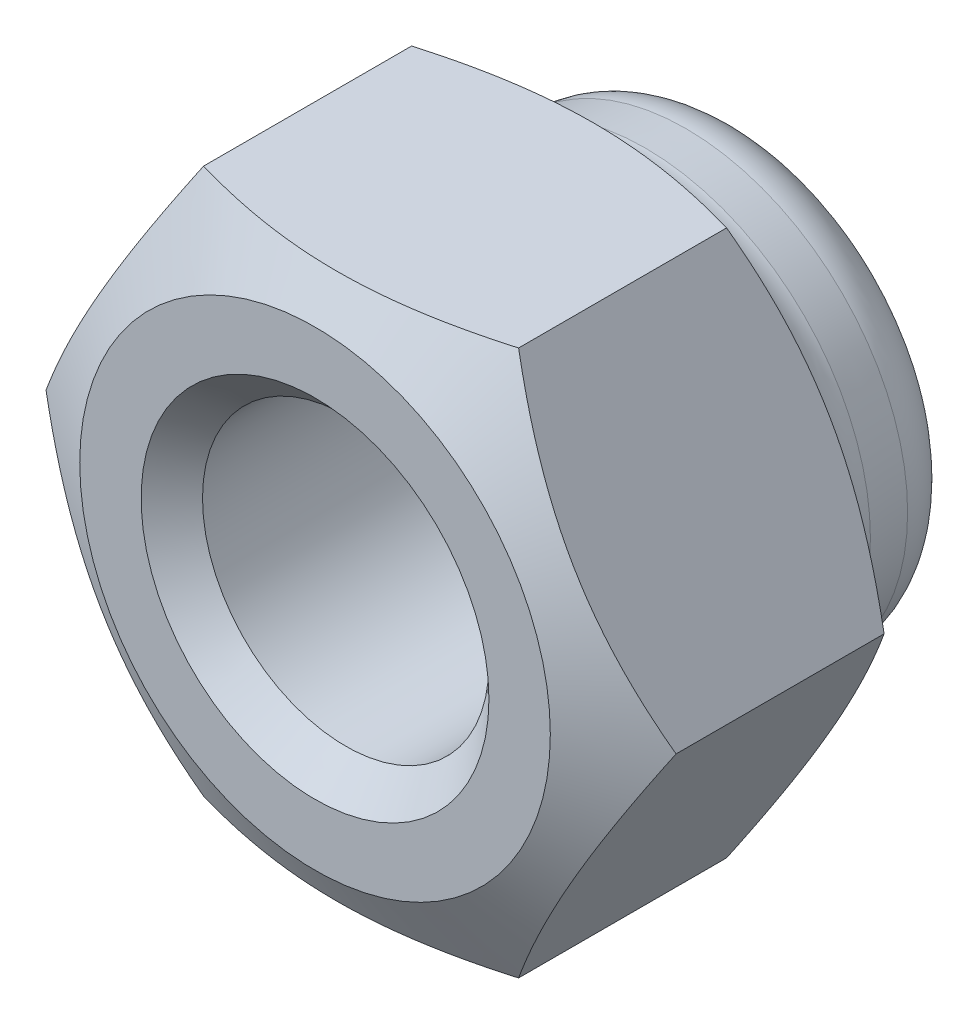
ISO-10303-21;
HEADER;
FILE_DESCRIPTION(('STEP AP214'),'2;1');
FILE_NAME('part.step','',(''),(''),'','','');
FILE_SCHEMA(('AUTOMOTIVE_DESIGN { 1 0 10303 214 1 1 1 1 }'));
ENDSEC;
DATA;
#1=APPLICATION_CONTEXT('core data for automotive mechanical design processes');
#2=APPLICATION_PROTOCOL_DEFINITION('international standard','automotive_design',2000,#1);
#3=PRODUCT_CONTEXT('',#1,'mechanical');
#4=PRODUCT('Part','Part','',(#3));
#5=PRODUCT_RELATED_PRODUCT_CATEGORY('part','',(#4));
#6=PRODUCT_DEFINITION_FORMATION('','',#4);
#7=PRODUCT_DEFINITION_CONTEXT('part definition',#1,'design');
#8=PRODUCT_DEFINITION('design','',#6,#7);
#9=PRODUCT_DEFINITION_SHAPE('','',#8);
#10=(LENGTH_UNIT() NAMED_UNIT(*) SI_UNIT(.MILLI.,.METRE.));
#11=(NAMED_UNIT(*) PLANE_ANGLE_UNIT() SI_UNIT($,.RADIAN.));
#12=(NAMED_UNIT(*) SI_UNIT($,.STERADIAN.) SOLID_ANGLE_UNIT());
#13=UNCERTAINTY_MEASURE_WITH_UNIT(LENGTH_MEASURE(1.E-05),#10,'distance_accuracy_value','');
#14=(GEOMETRIC_REPRESENTATION_CONTEXT(3) GLOBAL_UNCERTAINTY_ASSIGNED_CONTEXT((#13)) GLOBAL_UNIT_ASSIGNED_CONTEXT((#10,
#11,#12)) REPRESENTATION_CONTEXT('',''));
#15=CARTESIAN_POINT('',(0.,0.,0.));
#16=DIRECTION('',(0.,0.,1.));
#17=DIRECTION('',(1.,0.,0.));
#18=AXIS2_PLACEMENT_3D('',#15,#16,#17);
#19=CARTESIAN_POINT('',(0.,0.,-6.16127494350649));
#20=DIRECTION('',(0.,0.,1.));
#21=DIRECTION('',(1.,0.,0.));
#22=AXIS2_PLACEMENT_3D('',#19,#20,#21);
#23=TOROIDAL_SURFACE('',#22,2.38872505649352,0.138725056493513);
#24=CARTESIAN_POINT('',(0.,0.,-6.3));
#25=DIRECTION('',(0.,0.,1.));
#26=DIRECTION('',(1.,0.,0.));
#27=AXIS2_PLACEMENT_3D('',#24,#25,#26);
#28=CIRCLE('',#27,2.38872505649352);
#29=CARTESIAN_POINT('',(2.38872505649352,0.,-6.3));
#30=VERTEX_POINT('',#29);
#31=EDGE_CURVE('E111',#30,#30,#28,.T.);
#32=ORIENTED_EDGE('',*,*,#31,.F.);
#33=EDGE_LOOP('',(#32));
#34=FACE_BOUND('',#33,.T.);
#35=CARTESIAN_POINT('',(0.,0.,-6.16127494350648));
#36=DIRECTION('',(0.,0.,1.));
#37=DIRECTION('',(1.,0.,0.));
#38=AXIS2_PLACEMENT_3D('',#35,#36,#37);
#39=CIRCLE('',#38,2.25000000000001);
#40=CARTESIAN_POINT('',(2.25000000000001,0.,-6.16127494350648));
#41=VERTEX_POINT('',#40);
#42=EDGE_CURVE('E136',#41,#41,#39,.T.);
#43=ORIENTED_EDGE('',*,*,#42,.T.);
#44=EDGE_LOOP('',(#43));
#45=FACE_BOUND('',#44,.T.);
#46=ADVANCED_FACE('F38',(#34,#45),#23,.T.);
#47=CARTESIAN_POINT('',(0.,0.,-5.43872505649352));
#48=DIRECTION('',(0.,0.,1.));
#49=DIRECTION('',(1.,0.,0.));
#50=AXIS2_PLACEMENT_3D('',#47,#48,#49);
#51=TOROIDAL_SURFACE('',#50,2.38872505649352,0.86127494350648);
#52=CARTESIAN_POINT('',(0.,0.,-5.43872505649352));
#53=DIRECTION('',(0.,0.,1.));
#54=DIRECTION('',(1.,0.,0.));
#55=AXIS2_PLACEMENT_3D('',#52,#53,#54);
#56=CIRCLE('',#55,3.25);
#57=CARTESIAN_POINT('',(3.25,0.,-5.43872505649352));
#58=VERTEX_POINT('',#57);
#59=EDGE_CURVE('E115',#58,#58,#56,.T.);
#60=ORIENTED_EDGE('',*,*,#59,.F.);
#61=EDGE_LOOP('',(#60));
#62=FACE_BOUND('',#61,.T.);
#63=ORIENTED_EDGE('',*,*,#31,.T.);
#64=EDGE_LOOP('',(#63));
#65=FACE_BOUND('',#64,.T.);
#66=ADVANCED_FACE('F257',(#62,#65),#51,.T.);
#67=CARTESIAN_POINT('',(0.,0.,-5.43872505649352));
#68=DIRECTION('',(0.,0.,1.));
#69=DIRECTION('',(1.,0.,0.));
#70=AXIS2_PLACEMENT_3D('',#67,#68,#69);
#71=CONICAL_SURFACE('',#70,3.25,0.0872664625997129);
#72=CARTESIAN_POINT('',(0.,0.,-4.84100823763847));
#73=DIRECTION('',(0.,0.,1.));
#74=DIRECTION('',(1.,0.,0.));
#75=AXIS2_PLACEMENT_3D('',#72,#73,#74);
#76=CIRCLE('',#75,3.30229344564859);
#77=CARTESIAN_POINT('',(3.30229344564859,0.,-4.84100823763847));
#78=VERTEX_POINT('',#77);
#79=EDGE_CURVE('E127',#78,#78,#76,.T.);
#80=ORIENTED_EDGE('',*,*,#79,.F.);
#81=EDGE_LOOP('',(#80));
#82=FACE_BOUND('',#81,.T.);
#83=ORIENTED_EDGE('',*,*,#59,.T.);
#84=EDGE_LOOP('',(#83));
#85=FACE_BOUND('',#84,.T.);
#86=ADVANCED_FACE('F263',(#82,#85),#71,.T.);
#87=CARTESIAN_POINT('',(0.,0.,-4.84100823763847));
#88=DIRECTION('',(0.,0.,1.));
#89=DIRECTION('',(1.,0.,0.));
#90=AXIS2_PLACEMENT_3D('',#87,#88,#89);
#91=TOROIDAL_SURFACE('',#90,4.03450703228722,0.732213586638629);
#92=CARTESIAN_POINT('',(0.,0.,-4.4));
#93=DIRECTION('',(0.,0.,1.));
#94=DIRECTION('',(1.,0.,0.));
#95=AXIS2_PLACEMENT_3D('',#92,#93,#94);
#96=CIRCLE('',#95,3.45);
#97=CARTESIAN_POINT('',(3.45,0.,-4.4));
#98=VERTEX_POINT('',#97);
#99=EDGE_CURVE('E283',#98,#98,#96,.T.);
#100=ORIENTED_EDGE('',*,*,#99,.F.);
#101=EDGE_LOOP('',(#100));
#102=FACE_BOUND('',#101,.T.);
#103=ORIENTED_EDGE('',*,*,#79,.T.);
#104=EDGE_LOOP('',(#103));
#105=FACE_BOUND('',#104,.T.);
#106=ADVANCED_FACE('F314',(#102,#105),#91,.F.);
#107=CARTESIAN_POINT('',(0.,0.,11.954173971306));
#108=DIRECTION('',(0.,0.,1.));
#109=DIRECTION('',(1.,0.,0.));
#110=AXIS2_PLACEMENT_3D('',#107,#108,#109);
#111=CYLINDRICAL_SURFACE('',#110,2.);
#112=CARTESIAN_POINT('',(0.,0.,-6.01127494350648));
#113=DIRECTION('',(0.,0.,1.));
#114=DIRECTION('',(1.,0.,0.));
#115=AXIS2_PLACEMENT_3D('',#112,#113,#114);
#116=CIRCLE('',#115,2.);
#117=CARTESIAN_POINT('',(2.,0.,-6.01127494350648));
#118=VERTEX_POINT('',#117);
#119=EDGE_CURVE('E130',#118,#118,#116,.T.);
#120=ORIENTED_EDGE('',*,*,#119,.F.);
#121=EDGE_LOOP('',(#120));
#122=FACE_BOUND('',#121,.T.);
#123=CARTESIAN_POINT('',(0.,0.,-4.4));
#124=DIRECTION('',(0.,0.,1.));
#125=DIRECTION('',(1.,0.,0.));
#126=AXIS2_PLACEMENT_3D('',#123,#124,#125);
#127=CIRCLE('',#126,2.);
#128=CARTESIAN_POINT('',(2.,0.,-4.4));
#129=VERTEX_POINT('',#128);
#130=EDGE_CURVE('E43',#129,#129,#127,.T.);
#131=ORIENTED_EDGE('',*,*,#130,.T.);
#132=EDGE_LOOP('',(#131));
#133=FACE_BOUND('',#132,.T.);
#134=ADVANCED_FACE('F311',(#122,#133),#111,.F.);
#135=CARTESIAN_POINT('',(0.,2.,-6.01127494350648));
#136=DIRECTION('',(0.,0.,1.));
#137=DIRECTION('',(1.,0.,0.));
#138=AXIS2_PLACEMENT_3D('',#135,#136,#137);
#139=PLANE('',#138);
#140=CARTESIAN_POINT('',(0.,0.,-6.01127494350648));
#141=DIRECTION('',(0.,0.,1.));
#142=DIRECTION('',(1.,0.,0.));
#143=AXIS2_PLACEMENT_3D('',#140,#141,#142);
#144=CIRCLE('',#143,2.25000000000001);
#145=CARTESIAN_POINT('',(2.25000000000001,0.,-6.01127494350648));
#146=VERTEX_POINT('',#145);
#147=EDGE_CURVE('E133',#146,#146,#144,.T.);
#148=ORIENTED_EDGE('',*,*,#147,.F.);
#149=EDGE_LOOP('',(#148));
#150=FACE_BOUND('',#149,.T.);
#151=ORIENTED_EDGE('',*,*,#119,.T.);
#152=EDGE_LOOP('',(#151));
#153=FACE_BOUND('',#152,.T.);
#154=ADVANCED_FACE('F313',(#150,#153),#139,.F.);
#155=CARTESIAN_POINT('',(0.,0.,11.954173971306));
#156=DIRECTION('',(0.,0.,1.));
#157=DIRECTION('',(1.,0.,0.));
#158=AXIS2_PLACEMENT_3D('',#155,#156,#157);
#159=CYLINDRICAL_SURFACE('',#158,2.25000000000001);
#160=ORIENTED_EDGE('',*,*,#42,.F.);
#161=EDGE_LOOP('',(#160));
#162=FACE_BOUND('',#161,.T.);
#163=ORIENTED_EDGE('',*,*,#147,.T.);
#164=EDGE_LOOP('',(#163));
#165=FACE_BOUND('',#164,.T.);
#166=ADVANCED_FACE('F254',(#162,#165),#159,.F.);
#167=CARTESIAN_POINT('',(0.,0.,-3.72519176203755));
#168=DIRECTION('',(0.,0.,1.));
#169=DIRECTION('',(1.,0.,0.));
#170=AXIS2_PLACEMENT_3D('',#167,#168,#169);
#171=CONICAL_SURFACE('',#170,4.61880215351701,1.0471975511966);
#172=ORIENTED_EDGE('',*,*,#99,.T.);
#173=EDGE_LOOP('',(#172));
#174=FACE_BOUND('',#173,.T.);
#175=CARTESIAN_POINT('',(-6.08093823513525,-4.,-2.18956501440732));
#176=CARTESIAN_POINT('',(-5.9072077199973,-4.,-2.2733400712056));
#177=CARTESIAN_POINT('',(-5.7330649430113,-4.,-2.3562755470918));
#178=CARTESIAN_POINT('',(-5.38373509946638,-4.,-2.51999243555252));
#179=CARTESIAN_POINT('',(-5.20854786157008,-4.,-2.60077348210659));
#180=CARTESIAN_POINT('',(-4.8559465437711,-4.,-2.76013960141361));
#181=CARTESIAN_POINT('',(-4.67852543957851,-4.,-2.8387091891028));
#182=CARTESIAN_POINT('',(-4.3222283220917,-4.,-2.99246452980912));
#183=CARTESIAN_POINT('',(-4.14335238194136,-4.,-3.06765045171811));
#184=CARTESIAN_POINT('',(-3.7786067031648,-4.,-3.21587611861329));
#185=CARTESIAN_POINT('',(-3.59268519924523,-4.,-3.28878920838275));
#186=CARTESIAN_POINT('',(-3.21862234186601,-4.,-3.42879460242122));
#187=CARTESIAN_POINT('',(-3.03048073580445,-4.,-3.49588623693079));
#188=CARTESIAN_POINT('',(-2.65207198748475,-4.,-3.62239726459421));
#189=CARTESIAN_POINT('',(-2.46181047171922,-4.,-3.68183331104212));
#190=CARTESIAN_POINT('',(-2.07856248643454,-4.,-3.79104599210788));
#191=CARTESIAN_POINT('',(-1.88557693507218,-4.,-3.84082580179269));
#192=CARTESIAN_POINT('',(-1.49780451421222,-4.,-3.92800425853516));
#193=CARTESIAN_POINT('',(-1.30303173302433,-4.,-3.9654643825502));
#194=CARTESIAN_POINT('',(-0.911198366726411,-4.,-4.02579955703458));
#195=CARTESIAN_POINT('',(-0.714137961224425,-4.,-4.04867574475032));
#196=CARTESIAN_POINT('',(-0.321233336097853,-4.,-4.07771760472641));
#197=CARTESIAN_POINT('',(-0.125404655145363,-4.,-4.08408836772128));
#198=CARTESIAN_POINT('',(0.266095201698455,-4.,-4.08011214303908));
#199=CARTESIAN_POINT('',(0.461766371360695,-4.,-4.0697645238499));
#200=CARTESIAN_POINT('',(0.797699892769408,-4.,-4.03835977606374));
#201=CARTESIAN_POINT('',(0.938331372413441,-4.,-4.02105240631739));
#202=CARTESIAN_POINT('',(1.2184766824058,-4.,-3.97894828793129));
#203=CARTESIAN_POINT('',(1.35799034157019,-4.,-3.95415041387157));
#204=CARTESIAN_POINT('',(1.77471774717106,-4.,-3.86983408504439));
#205=CARTESIAN_POINT('',(2.04994511910427,-4.,-3.80041112676984));
#206=CARTESIAN_POINT('',(2.46136777731043,-4.,-3.68114714312966));
#207=CARTESIAN_POINT('',(2.59972134145531,-4.,-3.63833689291828));
#208=CARTESIAN_POINT('',(2.87508320800016,-4.,-3.54855095588989));
#209=CARTESIAN_POINT('',(3.01209150172308,-4.,-3.50157524222502));
#210=CARTESIAN_POINT('',(3.28481206760682,-4.,-3.4041886111652));
#211=CARTESIAN_POINT('',(3.4205248105739,-4.,-3.35377900040508));
#212=CARTESIAN_POINT('',(3.69084487886413,-4.,-3.25008945380774));
#213=CARTESIAN_POINT('',(3.82545221461264,-4.,-3.19680954507686));
#214=CARTESIAN_POINT('',(4.13200825403916,-4.,-3.07229737070055));
#215=CARTESIAN_POINT('',(4.30363931346054,-4.,-3.00028468894108));
#216=CARTESIAN_POINT('',(4.64555033606362,-4.,-2.85311242153985));
#217=CARTESIAN_POINT('',(4.81583023495983,-4.,-2.77795268722296));
#218=CARTESIAN_POINT('',(5.15527612835315,-4.,-2.62509206785114));
#219=CARTESIAN_POINT('',(5.32444193760053,-4.,-2.54739077239538));
#220=CARTESIAN_POINT('',(5.6618140185516,-4.,-2.38992946119094));
#221=CARTESIAN_POINT('',(5.83002027291513,-4.,-2.31016940838137));
#222=CARTESIAN_POINT('',(6.33371414711814,-4.,-2.06824046720063));
#223=CARTESIAN_POINT('',(6.66799150373664,-4.,-1.90355291434177));
#224=CARTESIAN_POINT('',(7.33422902998934,-4.,-1.5695574486934));
#225=CARTESIAN_POINT('',(7.66618912522945,-4.,-1.40024938841454));
#226=CARTESIAN_POINT('',(8.30256102252532,-4.,-1.07164832785719));
#227=CARTESIAN_POINT('',(8.60710167211459,-4.,-0.912604408573283));
#228=CARTESIAN_POINT('',(9.21506522849463,-4.,-0.59237680702228));
#229=CARTESIAN_POINT('',(9.51848810310192,-4.,-0.431193063750126));
#230=CARTESIAN_POINT('',(10.1238060042472,-4.,-0.107528653975275));
#231=CARTESIAN_POINT('',(10.4257029105381,-4.,0.0549485014334457));
#232=CARTESIAN_POINT('',(11.0287758434504,-4.,0.381201743100219));
#233=CARTESIAN_POINT('',(11.3299519035736,-4.,0.544977767403946));
#234=CARTESIAN_POINT('',(11.6308594447685,-4.,0.709242223634977));
#235=B_SPLINE_CURVE_WITH_KNOTS('',3,(#175,#176,#177,#178,#179,#180,#181,#182,#183,#184,#185,
#186,#187,#188,#189,#190,#191,#192,#193,#194,#195,#196,#197,#198,#199,#200,#201,#202,#203,#204,
#205,#206,#207,#208,#209,#210,#211,#212,#213,#214,#215,#216,#217,#218,#219,#220,#221,#222,#223,
#224,#225,#226,#227,#228,#229,#230,#231,#232,#233,#234),.UNSPECIFIED.,.F.,.F.,(4,2,2,2,2,2,2,2,
2,2,2,2,2,2,2,2,2,2,2,2,2,2,2,2,2,2,2,2,2,4),(0.,0.578631039276284,1.15735976511556,
1.73945083153598,2.32151281123982,2.9205603426648,3.51967670347957,4.11746696013193,
4.71506032295779,5.30962469010468,5.90414268781474,6.49123717867284,7.07835384667434,
7.50322277978485,7.92815557962507,8.77854012444459,9.21298362185075,9.64742991960063,
10.0817118194367,10.5159896187462,11.0743276120865,11.6326920126257,12.1911470250296,
12.7496120975246,13.8674829625497,14.9853895525102,16.0160867873718,17.0468134701496,
18.0753356839375,19.1038091301562),.UNSPECIFIED.);
#236=CARTESIAN_POINT('',(-2.3094010767585,-4.,-3.72519176203755));
#237=VERTEX_POINT('',#236);
#238=CARTESIAN_POINT('',(2.30940107675851,-4.,-3.72519176203755));
#239=VERTEX_POINT('',#238);
#240=EDGE_CURVE('E107',#237,#239,#235,.T.);
#241=ORIENTED_EDGE('',*,*,#240,.F.);
#242=CARTESIAN_POINT('',(-4.61891762357084,0.000200000000005311,-3.72512509287095));
#243=CARTESIAN_POINT('',(-4.51743148381381,-0.175579150323223,-3.78373947829743));
#244=CARTESIAN_POINT('',(-4.41506932144052,-0.352875616326375,-3.83704703048345));
#245=CARTESIAN_POINT('',(-4.20857250547739,-0.7105385931757,-3.93009568119931));
#246=CARTESIAN_POINT('',(-4.10443418285647,-0.890911458970145,-3.96980386291601));
#247=CARTESIAN_POINT('',(-3.89744813015756,-1.24942181870278,-4.03161513666543));
#248=CARTESIAN_POINT('',(-3.79463224655059,-1.42750415293514,-4.05412962042282));
#249=CARTESIAN_POINT('',(-3.58851671999023,-1.7845067171665,-4.08100672879913));
#250=CARTESIAN_POINT('',(-3.48521782616117,-1.96342564964409,-4.08539161051877));
#251=CARTESIAN_POINT('',(-3.29219970504619,-2.29774284219672,-4.07626727900574));
#252=CARTESIAN_POINT('',(-3.20245157692486,-2.45319115998706,-4.06499839795772));
#253=CARTESIAN_POINT('',(-3.02354002635497,-2.76307505563505,-4.02928336114752));
#254=CARTESIAN_POINT('',(-2.93437722268073,-2.91750956174412,-4.00482500623418));
#255=CARTESIAN_POINT('',(-2.75509682012354,-3.22803232777457,-3.94368128702643));
#256=CARTESIAN_POINT('',(-2.6650019108942,-3.3840812880631,-3.90673674829085));
#257=CARTESIAN_POINT('',(-2.48615580200001,-3.69385183540383,-3.82288727939769));
#258=CARTESIAN_POINT('',(-2.39740231122585,-3.84757739077378,-3.77600204973298));
#259=CARTESIAN_POINT('',(-2.30928560670467,-4.0002,-3.72512509287095));
#260=B_SPLINE_CURVE_WITH_KNOTS('',3,(#242,#243,#244,#245,#246,#247,#248,#249,#250,#251,#252,
#253,#254,#255,#256,#257,#258,#259),.UNSPECIFIED.,.F.,.F.,(4,2,2,2,2,2,2,2,4),(0.,
0.634047835695965,1.26961969224543,1.88946157213122,2.50854226669297,3.04757825393385,
3.58711366126903,4.13861653143764,4.68903648037743),.UNSPECIFIED.);
#261=CARTESIAN_POINT('',(-4.61880215351701,0.,-3.72519176203755));
#262=VERTEX_POINT('',#261);
#263=EDGE_CURVE('E204',#262,#237,#260,.T.);
#264=ORIENTED_EDGE('',*,*,#263,.F.);
#265=CARTESIAN_POINT('',(-2.30928560670467,4.0002,-3.72512509287095));
#266=CARTESIAN_POINT('',(-2.41077174646171,3.82442084967677,-3.78373947829743));
#267=CARTESIAN_POINT('',(-2.513133908835,3.64712438367362,-3.83704703048345));
#268=CARTESIAN_POINT('',(-2.71963072479812,3.28946140682429,-3.93009568119931));
#269=CARTESIAN_POINT('',(-2.82376904741904,3.10908854102985,-3.96980386291601));
#270=CARTESIAN_POINT('',(-3.03075510011795,2.75057818129721,-4.03161513666543));
#271=CARTESIAN_POINT('',(-3.13357098372492,2.57249584706486,-4.05412962042282));
#272=CARTESIAN_POINT('',(-3.33968651028528,2.21549328283349,-4.08100672879913));
#273=CARTESIAN_POINT('',(-3.44298540411434,2.0365743503559,-4.08539161051877));
#274=CARTESIAN_POINT('',(-3.63600352522932,1.70225715780327,-4.07626727900574));
#275=CARTESIAN_POINT('',(-3.72575165335065,1.54680884001294,-4.06499839795772));
#276=CARTESIAN_POINT('',(-3.90466320392054,1.23692494436495,-4.02928336114752));
#277=CARTESIAN_POINT('',(-3.99382600759478,1.08249043825587,-4.00482500623418));
#278=CARTESIAN_POINT('',(-4.17310641015197,0.771967672225426,-3.94368128702642));
#279=CARTESIAN_POINT('',(-4.26320131938131,0.615918711936902,-3.90673674829085));
#280=CARTESIAN_POINT('',(-4.4420474282755,0.306148164596166,-3.82288727939769));
#281=CARTESIAN_POINT('',(-4.53080091904966,0.152422609226226,-3.77600204973298));
#282=CARTESIAN_POINT('',(-4.61891762357084,-0.000199999999994469,-3.72512509287095));
#283=B_SPLINE_CURVE_WITH_KNOTS('',3,(#265,#266,#267,#268,#269,#270,#271,#272,#273,#274,#275,
#276,#277,#278,#279,#280,#281,#282),.UNSPECIFIED.,.F.,.F.,(4,2,2,2,2,2,2,2,4),(0.,
0.634047835695965,1.26961969224543,1.88946157213122,2.50854226669297,3.04757825393385,
3.58711366126903,4.13861653143763,4.68903648037742),.UNSPECIFIED.);
#284=CARTESIAN_POINT('',(-2.3094010767585,4.,-3.72519176203755));
#285=VERTEX_POINT('',#284);
#286=EDGE_CURVE('E212',#285,#262,#283,.T.);
#287=ORIENTED_EDGE('',*,*,#286,.F.);
#288=CARTESIAN_POINT('',(-6.08093823513526,4.,-2.18956501440732));
#289=CARTESIAN_POINT('',(-5.9072077199973,4.,-2.2733400712056));
#290=CARTESIAN_POINT('',(-5.7330649430113,4.,-2.35627554709179));
#291=CARTESIAN_POINT('',(-5.38373509946639,4.,-2.51999243555252));
#292=CARTESIAN_POINT('',(-5.20854786157008,4.,-2.60077348210659));
#293=CARTESIAN_POINT('',(-4.85594654377111,4.,-2.76013960141361));
#294=CARTESIAN_POINT('',(-4.67852543957852,4.,-2.8387091891028));
#295=CARTESIAN_POINT('',(-4.32222832209171,4.,-2.99246452980911));
#296=CARTESIAN_POINT('',(-4.14335238194136,4.,-3.0676504517181));
#297=CARTESIAN_POINT('',(-3.77860670316481,4.,-3.21587611861329));
#298=CARTESIAN_POINT('',(-3.59268519924523,4.,-3.28878920838275));
#299=CARTESIAN_POINT('',(-3.21862234186601,4.,-3.42879460242121));
#300=CARTESIAN_POINT('',(-3.03048073580445,4.,-3.49588623693078));
#301=CARTESIAN_POINT('',(-2.65207198748475,4.,-3.62239726459421));
#302=CARTESIAN_POINT('',(-2.46181047171922,4.,-3.68183331104211));
#303=CARTESIAN_POINT('',(-2.07856248643454,4.,-3.79104599210788));
#304=CARTESIAN_POINT('',(-1.88557693507218,4.,-3.84082580179268));
#305=CARTESIAN_POINT('',(-1.49780451421223,4.,-3.92800425853516));
#306=CARTESIAN_POINT('',(-1.30303173302433,4.,-3.96546438255019));
#307=CARTESIAN_POINT('',(-0.911198366726414,4.,-4.02579955703458));
#308=CARTESIAN_POINT('',(-0.714137961224427,4.,-4.04867574475032));
#309=CARTESIAN_POINT('',(-0.321233336097854,4.,-4.0777176047264));
#310=CARTESIAN_POINT('',(-0.125404655145364,4.,-4.08408836772127));
#311=CARTESIAN_POINT('',(0.266095201698454,4.,-4.08011214303908));
#312=CARTESIAN_POINT('',(0.461766371360694,4.,-4.0697645238499));
#313=CARTESIAN_POINT('',(0.797699892769408,4.,-4.03835977606374));
#314=CARTESIAN_POINT('',(0.938331372413441,4.,-4.02105240631739));
#315=CARTESIAN_POINT('',(1.2184766824058,4.,-3.97894828793129));
#316=CARTESIAN_POINT('',(1.35799034157019,4.,-3.95415041387157));
#317=CARTESIAN_POINT('',(1.77471774717106,4.,-3.86983408504439));
#318=CARTESIAN_POINT('',(2.04994511910427,4.,-3.80041112676984));
#319=CARTESIAN_POINT('',(2.46136777731043,4.,-3.68114714312966));
#320=CARTESIAN_POINT('',(2.59972134145531,4.,-3.63833689291827));
#321=CARTESIAN_POINT('',(2.87508320800016,4.,-3.54855095588989));
#322=CARTESIAN_POINT('',(3.01209150172308,4.,-3.50157524222502));
#323=CARTESIAN_POINT('',(3.28481206760683,4.,-3.4041886111652));
#324=CARTESIAN_POINT('',(3.4205248105739,4.,-3.35377900040508));
#325=CARTESIAN_POINT('',(3.69084487886413,4.,-3.25008945380773));
#326=CARTESIAN_POINT('',(3.82545221461264,4.,-3.19680954507686));
#327=CARTESIAN_POINT('',(4.13200825403916,4.,-3.07229737070055));
#328=CARTESIAN_POINT('',(4.30363931346055,4.,-3.00028468894108));
#329=CARTESIAN_POINT('',(4.64555033606362,4.,-2.85311242153985));
#330=CARTESIAN_POINT('',(4.81583023495983,4.,-2.77795268722296));
#331=CARTESIAN_POINT('',(5.15527612835315,4.,-2.62509206785114));
#332=CARTESIAN_POINT('',(5.32444193760053,4.,-2.54739077239538));
#333=CARTESIAN_POINT('',(5.6618140185516,4.,-2.38992946119093));
#334=CARTESIAN_POINT('',(5.83002027291513,4.,-2.31016940838137));
#335=CARTESIAN_POINT('',(6.33371414711814,4.,-2.06824046720063));
#336=CARTESIAN_POINT('',(6.66799150373664,4.,-1.90355291434177));
#337=CARTESIAN_POINT('',(7.33422902998934,4.,-1.56955744869339));
#338=CARTESIAN_POINT('',(7.66618912522945,4.,-1.40024938841454));
#339=CARTESIAN_POINT('',(8.30256102252532,4.,-1.07164832785719));
#340=CARTESIAN_POINT('',(8.60710167211459,4.,-0.912604408573281));
#341=CARTESIAN_POINT('',(9.21506522849463,4.,-0.592376807022279));
#342=CARTESIAN_POINT('',(9.51848810310192,4.,-0.431193063750126));
#343=CARTESIAN_POINT('',(10.1238060042471,4.,-0.107528653975277));
#344=CARTESIAN_POINT('',(10.4257029105381,4.00000000000001,0.0549485014334438));
#345=CARTESIAN_POINT('',(11.0287758434504,4.00000000000001,0.381201743100216));
#346=CARTESIAN_POINT('',(11.3299519035736,4.00000000000001,0.544977767403942));
#347=CARTESIAN_POINT('',(11.6308594447684,4.00000000000001,0.709242223634973));
#348=B_SPLINE_CURVE_WITH_KNOTS('',3,(#288,#289,#290,#291,#292,#293,#294,#295,#296,#297,#298,
#299,#300,#301,#302,#303,#304,#305,#306,#307,#308,#309,#310,#311,#312,#313,#314,#315,#316,#317,
#318,#319,#320,#321,#322,#323,#324,#325,#326,#327,#328,#329,#330,#331,#332,#333,#334,#335,#336,
#337,#338,#339,#340,#341,#342,#343,#344,#345,#346,#347),.UNSPECIFIED.,.F.,.F.,(4,2,2,2,2,2,2,2,
2,2,2,2,2,2,2,2,2,2,2,2,2,2,2,2,2,2,2,2,2,4),(0.,0.578631039276284,1.15735976511556,
1.73945083153598,2.32151281123982,2.9205603426648,3.51967670347957,4.11746696013193,
4.71506032295779,5.30962469010469,5.90414268781475,6.49123717867285,7.07835384667434,
7.50322277978486,7.92815557962507,8.7785401244446,9.21298362185076,9.64742991960063,
10.0817118194367,10.5159896187462,11.0743276120865,11.6326920126257,12.1911470250296,
12.7496120975246,13.8674829625497,14.9853895525102,16.0160867873718,17.0468134701496,
18.0753356839375,19.1038091301562),.UNSPECIFIED.);
#349=CARTESIAN_POINT('',(2.3094010767585,4.,-3.72519176203755));
#350=VERTEX_POINT('',#349);
#351=EDGE_CURVE('E56',#350,#285,#348,.F.);
#352=ORIENTED_EDGE('',*,*,#351,.F.);
#353=CARTESIAN_POINT('',(4.61891762357085,-0.000199999999999652,-3.72512509287095));
#354=CARTESIAN_POINT('',(4.51743148381381,0.175579150323228,-3.78373947829743));
#355=CARTESIAN_POINT('',(4.41506932144052,0.352875616326381,-3.83704703048345));
#356=CARTESIAN_POINT('',(4.2085725054774,0.710538593175706,-3.93009568119931));
#357=CARTESIAN_POINT('',(4.10443418285647,0.89091145897015,-3.96980386291601));
#358=CARTESIAN_POINT('',(3.89744813015756,1.24942181870279,-4.03161513666543));
#359=CARTESIAN_POINT('',(3.7946322465506,1.42750415293514,-4.05412962042282));
#360=CARTESIAN_POINT('',(3.58851671999023,1.78450671716651,-4.08100672879913));
#361=CARTESIAN_POINT('',(3.48521782616117,1.9634256496441,-4.08539161051877));
#362=CARTESIAN_POINT('',(3.29219970504619,2.29774284219673,-4.07626727900574));
#363=CARTESIAN_POINT('',(3.20245157692486,2.45319115998706,-4.06499839795772));
#364=CARTESIAN_POINT('',(3.02354002635497,2.76307505563505,-4.02928336114752));
#365=CARTESIAN_POINT('',(2.93437722268073,2.91750956174413,-4.00482500623418));
#366=CARTESIAN_POINT('',(2.75509682012354,3.22803232777458,-3.94368128702643));
#367=CARTESIAN_POINT('',(2.6650019108942,3.3840812880631,-3.90673674829085));
#368=CARTESIAN_POINT('',(2.486155802,3.69385183540384,-3.82288727939769));
#369=CARTESIAN_POINT('',(2.39740231122584,3.84757739077378,-3.77600204973298));
#370=CARTESIAN_POINT('',(2.30928560670466,4.0002,-3.72512509287095));
#371=B_SPLINE_CURVE_WITH_KNOTS('',3,(#353,#354,#355,#356,#357,#358,#359,#360,#361,#362,#363,
#364,#365,#366,#367,#368,#369,#370),.UNSPECIFIED.,.F.,.F.,(4,2,2,2,2,2,2,2,4),(0.,
0.634047835695966,1.26961969224543,1.88946157213122,2.50854226669297,3.04757825393386,
3.58711366126903,4.13861653143764,4.68903648037743),.UNSPECIFIED.);
#372=CARTESIAN_POINT('',(4.61880215351701,0.,-3.72519176203755));
#373=VERTEX_POINT('',#372);
#374=EDGE_CURVE('E91',#373,#350,#371,.T.);
#375=ORIENTED_EDGE('',*,*,#374,.F.);
#376=CARTESIAN_POINT('',(2.30928560670467,-4.0002,-3.72512509287095));
#377=CARTESIAN_POINT('',(2.41077174646171,-3.82442084967677,-3.78373947829743));
#378=CARTESIAN_POINT('',(2.513133908835,-3.64712438367362,-3.83704703048345));
#379=CARTESIAN_POINT('',(2.71963072479812,-3.28946140682429,-3.93009568119931));
#380=CARTESIAN_POINT('',(2.82376904741905,-3.10908854102985,-3.96980386291601));
#381=CARTESIAN_POINT('',(3.03075510011796,-2.75057818129721,-4.03161513666543));
#382=CARTESIAN_POINT('',(3.13357098372492,-2.57249584706486,-4.05412962042282));
#383=CARTESIAN_POINT('',(3.33968651028529,-2.21549328283349,-4.08100672879913));
#384=CARTESIAN_POINT('',(3.44298540411434,-2.0365743503559,-4.08539161051877));
#385=CARTESIAN_POINT('',(3.63600352522933,-1.70225715780327,-4.07626727900574));
#386=CARTESIAN_POINT('',(3.72575165335065,-1.54680884001293,-4.06499839795772));
#387=CARTESIAN_POINT('',(3.90466320392055,-1.23692494436494,-4.02928336114752));
#388=CARTESIAN_POINT('',(3.99382600759479,-1.08249043825587,-4.00482500623418));
#389=CARTESIAN_POINT('',(4.17310641015197,-0.771967672225422,-3.94368128702642));
#390=CARTESIAN_POINT('',(4.26320131938131,-0.615918711936898,-3.90673674829085));
#391=CARTESIAN_POINT('',(4.44204742827551,-0.306148164596161,-3.82288727939769));
#392=CARTESIAN_POINT('',(4.53080091904967,-0.152422609226221,-3.77600204973297));
#393=CARTESIAN_POINT('',(4.61891762357085,0.000200000000000166,-3.72512509287095));
#394=B_SPLINE_CURVE_WITH_KNOTS('',3,(#376,#377,#378,#379,#380,#381,#382,#383,#384,#385,#386,
#387,#388,#389,#390,#391,#392,#393),.UNSPECIFIED.,.F.,.F.,(4,2,2,2,2,2,2,2,4),(0.,
0.634047835695964,1.26961969224543,1.88946157213122,2.50854226669297,3.04757825393385,
3.58711366126903,4.13861653143763,4.68903648037743),.UNSPECIFIED.);
#395=EDGE_CURVE('E94',#239,#373,#394,.T.);
#396=ORIENTED_EDGE('',*,*,#395,.F.);
#397=EDGE_LOOP('',(#241,#264,#287,#352,#375,#396));
#398=FACE_BOUND('',#397,.T.);
#399=ADVANCED_FACE('F93',(#174,#398),#171,.T.);
#400=CARTESIAN_POINT('',(4.61880215351701,0.,-4.4));
#401=DIRECTION('',(0.866025403784438,0.500000000000001,0.));
#402=DIRECTION('',(-0.500000000000001,0.866025403784438,0.));
#403=AXIS2_PLACEMENT_3D('',#400,#401,#402);
#404=PLANE('',#403);
#405=DIRECTION('',(0.,0.,1.));
#406=VECTOR('',#405,1.);
#407=CARTESIAN_POINT('',(2.3094010767585,4.,-4.4));
#408=LINE('',#407,#406);
#409=CARTESIAN_POINT('',(2.3094010767585,4.,-0.674808237962447));
#410=VERTEX_POINT('',#409);
#411=EDGE_CURVE('E110',#350,#410,#408,.T.);
#412=ORIENTED_EDGE('',*,*,#411,.T.);
#413=CARTESIAN_POINT('',(2.30928560670466,4.0002,-0.674874907129051));
#414=CARTESIAN_POINT('',(2.4107717464617,3.82442084967677,-0.616260521702567));
#415=CARTESIAN_POINT('',(2.51313390883499,3.64712438367362,-0.562952969516548));
#416=CARTESIAN_POINT('',(2.71963072479811,3.2894614068243,-0.46990431880069));
#417=CARTESIAN_POINT('',(2.82376904741904,3.10908854102985,-0.430196137083991));
#418=CARTESIAN_POINT('',(3.03075510011795,2.75057818129721,-0.368384863334567));
#419=CARTESIAN_POINT('',(3.13357098372491,2.57249584706486,-0.345870379577177));
#420=CARTESIAN_POINT('',(3.33968651028528,2.2154932828335,-0.318993271200871));
#421=CARTESIAN_POINT('',(3.44298540411434,2.0365743503559,-0.314608389481233));
#422=CARTESIAN_POINT('',(3.63600352522932,1.70225715780327,-0.323732720994259));
#423=CARTESIAN_POINT('',(3.72575165335064,1.54680884001294,-0.335001602042283));
#424=CARTESIAN_POINT('',(3.90466320392054,1.23692494436495,-0.370716638852481));
#425=CARTESIAN_POINT('',(3.99382600759478,1.08249043825587,-0.395174993765821));
#426=CARTESIAN_POINT('',(4.17310641015197,0.771967672225424,-0.456318712973577));
#427=CARTESIAN_POINT('',(4.26320131938131,0.6159187119369,-0.493263251709151));
#428=CARTESIAN_POINT('',(4.44204742827551,0.306148164596162,-0.577112720602314));
#429=CARTESIAN_POINT('',(4.53080091904966,0.152422609226221,-0.623997950267026));
#430=CARTESIAN_POINT('',(4.61891762357085,-0.000199999999999871,-0.674874907129053));
#431=B_SPLINE_CURVE_WITH_KNOTS('',3,(#413,#414,#415,#416,#417,#418,#419,#420,#421,#422,#423,
#424,#425,#426,#427,#428,#429,#430),.UNSPECIFIED.,.F.,.F.,(4,2,2,2,2,2,2,2,4),(0.,
0.634047835695965,1.26961969224543,1.88946157213122,2.50854226669297,3.04757825393386,
3.58711366126903,4.13861653143764,4.68903648037743),.UNSPECIFIED.);
#432=CARTESIAN_POINT('',(4.61880215351701,0.,-0.674808237962449));
#433=VERTEX_POINT('',#432);
#434=EDGE_CURVE('E106',#410,#433,#431,.T.);
#435=ORIENTED_EDGE('',*,*,#434,.T.);
#436=DIRECTION('',(0.,0.,1.));
#437=VECTOR('',#436,1.);
#438=CARTESIAN_POINT('',(4.61880215351701,0.,-4.4));
#439=LINE('',#438,#437);
#440=EDGE_CURVE('E105',#373,#433,#439,.T.);
#441=ORIENTED_EDGE('',*,*,#440,.F.);
#442=ORIENTED_EDGE('',*,*,#374,.T.);
#443=EDGE_LOOP('',(#412,#435,#441,#442));
#444=FACE_BOUND('',#443,.T.);
#445=ADVANCED_FACE('F109',(#444),#404,.T.);
#446=CARTESIAN_POINT('',(2.3094010767585,4.,-4.4));
#447=DIRECTION('',(0.,1.,0.));
#448=DIRECTION('',(-1.,0.,0.));
#449=AXIS2_PLACEMENT_3D('',#446,#447,#448);
#450=PLANE('',#449);
#451=DIRECTION('',(0.,0.,1.));
#452=VECTOR('',#451,1.);
#453=CARTESIAN_POINT('',(-2.3094010767585,4.,-4.4));
#454=LINE('',#453,#452);
#455=CARTESIAN_POINT('',(-2.3094010767585,4.,-0.674808237962447));
#456=VERTEX_POINT('',#455);
#457=EDGE_CURVE('E112',#285,#456,#454,.T.);
#458=ORIENTED_EDGE('',*,*,#457,.T.);
#459=CARTESIAN_POINT('',(-6.08093823513526,4.,-2.21043498559268));
#460=CARTESIAN_POINT('',(-5.9072077199973,4.,-2.1266599287944));
#461=CARTESIAN_POINT('',(-5.7330649430113,4.,-2.04372445290821));
#462=CARTESIAN_POINT('',(-5.38373509946639,4.,-1.88000756444748));
#463=CARTESIAN_POINT('',(-5.20854786157008,4.,-1.79922651789341));
#464=CARTESIAN_POINT('',(-4.85594654377111,4.,-1.63986039858639));
#465=CARTESIAN_POINT('',(-4.67852543957852,4.,-1.5612908108972));
#466=CARTESIAN_POINT('',(-4.32222832209171,4.,-1.40753547019089));
#467=CARTESIAN_POINT('',(-4.14335238194136,4.,-1.3323495482819));
#468=CARTESIAN_POINT('',(-3.77860670316481,4.,-1.18412388138671));
#469=CARTESIAN_POINT('',(-3.59268519924523,4.,-1.11121079161725));
#470=CARTESIAN_POINT('',(-3.21862234186601,4.,-0.971205397578786));
#471=CARTESIAN_POINT('',(-3.03048073580445,4.,-0.904113763069216));
#472=CARTESIAN_POINT('',(-2.65207198748476,4.,-0.777602735405794));
#473=CARTESIAN_POINT('',(-2.46181047171922,4.,-0.718166688957888));
#474=CARTESIAN_POINT('',(-2.07856248643454,4.,-0.60895400789212));
#475=CARTESIAN_POINT('',(-1.88557693507218,4.,-0.559174198207318));
#476=CARTESIAN_POINT('',(-1.49780451421222,4.,-0.471995741464841));
#477=CARTESIAN_POINT('',(-1.30303173302433,4.,-0.434535617449807));
#478=CARTESIAN_POINT('',(-0.911198366726413,4.,-0.374200442965421));
#479=CARTESIAN_POINT('',(-0.714137961224427,4.,-0.351324255249681));
#480=CARTESIAN_POINT('',(-0.321233336097854,4.,-0.322282395273598));
#481=CARTESIAN_POINT('',(-0.125404655145364,4.,-0.315911632278728));
#482=CARTESIAN_POINT('',(0.266095201698454,4.,-0.319887856960918));
#483=CARTESIAN_POINT('',(0.461766371360694,4.,-0.330235476150106));
#484=CARTESIAN_POINT('',(0.797699892769407,4.,-0.361640223936262));
#485=CARTESIAN_POINT('',(0.938331372413441,4.,-0.378947593682609));
#486=CARTESIAN_POINT('',(1.2184766824058,4.,-0.421051712068714));
#487=CARTESIAN_POINT('',(1.35799034157019,4.,-0.445849586128431));
#488=CARTESIAN_POINT('',(1.77471774717106,4.,-0.530165914955609));
#489=CARTESIAN_POINT('',(2.04994511910427,4.,-0.59958887323016));
#490=CARTESIAN_POINT('',(2.46136777731043,4.,-0.718852856870344));
#491=CARTESIAN_POINT('',(2.59972134145531,4.,-0.761663107081726));
#492=CARTESIAN_POINT('',(2.87508320800017,4.,-0.851449044110112));
#493=CARTESIAN_POINT('',(3.01209150172308,4.,-0.898424757774985));
#494=CARTESIAN_POINT('',(3.28481206760683,4.,-0.9958113888348));
#495=CARTESIAN_POINT('',(3.4205248105739,4.,-1.04622099959492));
#496=CARTESIAN_POINT('',(3.69084487886414,4.,-1.14991054619227));
#497=CARTESIAN_POINT('',(3.82545221461264,4.,-1.20319045492314));
#498=CARTESIAN_POINT('',(4.13200825403916,4.,-1.32770262929945));
#499=CARTESIAN_POINT('',(4.30363931346055,4.,-1.39971531105892));
#500=CARTESIAN_POINT('',(4.64555033606362,4.,-1.54688757846015));
#501=CARTESIAN_POINT('',(4.81583023495984,4.,-1.62204731277704));
#502=CARTESIAN_POINT('',(5.15527612835315,4.,-1.77490793214886));
#503=CARTESIAN_POINT('',(5.32444193760054,4.,-1.85260922760462));
#504=CARTESIAN_POINT('',(5.6618140185516,4.,-2.01007053880907));
#505=CARTESIAN_POINT('',(5.83002027291514,4.,-2.08983059161863));
#506=CARTESIAN_POINT('',(6.33371414711815,4.,-2.33175953279937));
#507=CARTESIAN_POINT('',(6.66799150373664,4.,-2.49644708565823));
#508=CARTESIAN_POINT('',(7.33422902998934,4.,-2.8304425513066));
#509=CARTESIAN_POINT('',(7.66618912522945,4.,-2.99975061158546));
#510=CARTESIAN_POINT('',(8.30256102252532,4.,-3.32835167214281));
#511=CARTESIAN_POINT('',(8.60710167211459,4.,-3.48739559142672));
#512=CARTESIAN_POINT('',(9.21506522849463,4.,-3.80762319297772));
#513=CARTESIAN_POINT('',(9.51848810310192,4.,-3.96880693624987));
#514=CARTESIAN_POINT('',(10.1238060042472,4.,-4.29247134602472));
#515=CARTESIAN_POINT('',(10.4257029105381,4.00000000000001,-4.45494850143344));
#516=CARTESIAN_POINT('',(11.0287758434504,4.00000000000001,-4.78120174310021));
#517=CARTESIAN_POINT('',(11.3299519035736,4.00000000000001,-4.94497776740394));
#518=CARTESIAN_POINT('',(11.6308594447684,4.00000000000001,-5.10924222363497));
#519=B_SPLINE_CURVE_WITH_KNOTS('',3,(#459,#460,#461,#462,#463,#464,#465,#466,#467,#468,#469,
#470,#471,#472,#473,#474,#475,#476,#477,#478,#479,#480,#481,#482,#483,#484,#485,#486,#487,#488,
#489,#490,#491,#492,#493,#494,#495,#496,#497,#498,#499,#500,#501,#502,#503,#504,#505,#506,#507,
#508,#509,#510,#511,#512,#513,#514,#515,#516,#517,#518),.UNSPECIFIED.,.F.,.F.,(4,2,2,2,2,2,2,2,
2,2,2,2,2,2,2,2,2,2,2,2,2,2,2,2,2,2,2,2,2,4),(0.,0.578631039276284,1.15735976511556,
1.73945083153598,2.32151281123982,2.9205603426648,3.51967670347957,4.11746696013193,
4.71506032295779,5.30962469010469,5.90414268781475,6.49123717867285,7.07835384667434,
7.50322277978486,7.92815557962507,8.7785401244446,9.21298362185076,9.64742991960063,
10.0817118194367,10.5159896187462,11.0743276120865,11.6326920126257,12.1911470250296,
12.7496120975246,13.8674829625497,14.9853895525102,16.0160867873718,17.0468134701496,
18.0753356839375,19.1038091301562),.UNSPECIFIED.);
#520=EDGE_CURVE('E172',#456,#410,#519,.T.);
#521=ORIENTED_EDGE('',*,*,#520,.T.);
#522=ORIENTED_EDGE('',*,*,#411,.F.);
#523=ORIENTED_EDGE('',*,*,#351,.T.);
#524=EDGE_LOOP('',(#458,#521,#522,#523));
#525=FACE_BOUND('',#524,.T.);
#526=ADVANCED_FACE('F244',(#525),#450,.T.);
#527=CARTESIAN_POINT('',(-2.3094010767585,4.,-4.4));
#528=DIRECTION('',(-0.866025403784438,0.5,0.));
#529=DIRECTION('',(-0.5,-0.866025403784439,0.));
#530=AXIS2_PLACEMENT_3D('',#527,#528,#529);
#531=PLANE('',#530);
#532=DIRECTION('',(0.,0.,1.));
#533=VECTOR('',#532,1.);
#534=CARTESIAN_POINT('',(-4.61880215351701,0.,-4.4));
#535=LINE('',#534,#533);
#536=CARTESIAN_POINT('',(-4.61880215351701,0.,-0.674808237962447));
#537=VERTEX_POINT('',#536);
#538=EDGE_CURVE('E120',#262,#537,#535,.T.);
#539=ORIENTED_EDGE('',*,*,#538,.T.);
#540=CARTESIAN_POINT('',(-4.61891762357084,-0.000199999999994779,-0.674874907129051));
#541=CARTESIAN_POINT('',(-4.5174314838138,0.175579150323233,-0.616260521702568));
#542=CARTESIAN_POINT('',(-4.41506932144052,0.352875616326386,-0.562952969516549));
#543=CARTESIAN_POINT('',(-4.20857250547739,0.710538593175711,-0.469904318800691));
#544=CARTESIAN_POINT('',(-4.10443418285647,0.890911458970155,-0.430196137083992));
#545=CARTESIAN_POINT('',(-3.89744813015756,1.24942181870279,-0.368384863334568));
#546=CARTESIAN_POINT('',(-3.79463224655059,1.42750415293515,-0.345870379577178));
#547=CARTESIAN_POINT('',(-3.58851671999023,1.78450671716651,-0.318993271200872));
#548=CARTESIAN_POINT('',(-3.48521782616117,1.9634256496441,-0.314608389481233));
#549=CARTESIAN_POINT('',(-3.29219970504619,2.29774284219673,-0.32373272099426));
#550=CARTESIAN_POINT('',(-3.20245157692486,2.45319115998707,-0.335001602042284));
#551=CARTESIAN_POINT('',(-3.02354002635497,2.76307505563506,-0.370716638852482));
#552=CARTESIAN_POINT('',(-2.93437722268073,2.91750956174413,-0.395174993765822));
#553=CARTESIAN_POINT('',(-2.75509682012354,3.22803232777458,-0.456318712973577));
#554=CARTESIAN_POINT('',(-2.6650019108942,3.3840812880631,-0.493263251709151));
#555=CARTESIAN_POINT('',(-2.48615580200001,3.69385183540384,-0.577112720602313));
#556=CARTESIAN_POINT('',(-2.39740231122585,3.84757739077378,-0.623997950267025));
#557=CARTESIAN_POINT('',(-2.30928560670467,4.0002,-0.674874907129051));
#558=B_SPLINE_CURVE_WITH_KNOTS('',3,(#540,#541,#542,#543,#544,#545,#546,#547,#548,#549,#550,
#551,#552,#553,#554,#555,#556,#557),.UNSPECIFIED.,.F.,.F.,(4,2,2,2,2,2,2,2,4),(0.,
0.634047835695965,1.26961969224543,1.88946157213122,2.50854226669297,3.04757825393385,
3.58711366126903,4.13861653143763,4.68903648037742),.UNSPECIFIED.);
#559=EDGE_CURVE('E180',#537,#456,#558,.T.);
#560=ORIENTED_EDGE('',*,*,#559,.T.);
#561=ORIENTED_EDGE('',*,*,#457,.F.);
#562=ORIENTED_EDGE('',*,*,#286,.T.);
#563=EDGE_LOOP('',(#539,#560,#561,#562));
#564=FACE_BOUND('',#563,.T.);
#565=ADVANCED_FACE('F197',(#564),#531,.T.);
#566=CARTESIAN_POINT('',(-4.61880215351701,0.,-4.4));
#567=DIRECTION('',(-0.866025403784439,-0.5,0.));
#568=DIRECTION('',(0.5,-0.866025403784439,0.));
#569=AXIS2_PLACEMENT_3D('',#566,#567,#568);
#570=PLANE('',#569);
#571=DIRECTION('',(0.,0.,1.));
#572=VECTOR('',#571,1.);
#573=CARTESIAN_POINT('',(-2.3094010767585,-4.,-4.4));
#574=LINE('',#573,#572);
#575=CARTESIAN_POINT('',(-2.3094010767585,-4.,-0.674808237962447));
#576=VERTEX_POINT('',#575);
#577=EDGE_CURVE('E48',#237,#576,#574,.T.);
#578=ORIENTED_EDGE('',*,*,#577,.T.);
#579=CARTESIAN_POINT('',(-2.30928560670467,-4.0002,-0.674874907129049));
#580=CARTESIAN_POINT('',(-2.4107717464617,-3.82442084967677,-0.616260521702566));
#581=CARTESIAN_POINT('',(-2.51313390883499,-3.64712438367362,-0.562952969516547));
#582=CARTESIAN_POINT('',(-2.71963072479811,-3.28946140682429,-0.469904318800689));
#583=CARTESIAN_POINT('',(-2.82376904741904,-3.10908854102985,-0.43019613708399));
#584=CARTESIAN_POINT('',(-3.03075510011795,-2.75057818129721,-0.368384863334566));
#585=CARTESIAN_POINT('',(-3.13357098372491,-2.57249584706486,-0.345870379577176));
#586=CARTESIAN_POINT('',(-3.33968651028528,-2.21549328283349,-0.318993271200869));
#587=CARTESIAN_POINT('',(-3.44298540411434,-2.0365743503559,-0.314608389481231));
#588=CARTESIAN_POINT('',(-3.63600352522932,-1.70225715780327,-0.323732720994257));
#589=CARTESIAN_POINT('',(-3.72575165335064,-1.54680884001293,-0.335001602042281));
#590=CARTESIAN_POINT('',(-3.90466320392054,-1.23692494436494,-0.370716638852479));
#591=CARTESIAN_POINT('',(-3.99382600759478,-1.08249043825587,-0.395174993765819));
#592=CARTESIAN_POINT('',(-4.17310641015197,-0.771967672225419,-0.456318712973575));
#593=CARTESIAN_POINT('',(-4.26320131938131,-0.615918711936894,-0.493263251709149));
#594=CARTESIAN_POINT('',(-4.4420474282755,-0.306148164596156,-0.577112720602312));
#595=CARTESIAN_POINT('',(-4.53080091904966,-0.152422609226216,-0.623997950267025));
#596=CARTESIAN_POINT('',(-4.61891762357084,0.000200000000005674,-0.674874907129051));
#597=B_SPLINE_CURVE_WITH_KNOTS('',3,(#579,#580,#581,#582,#583,#584,#585,#586,#587,#588,#589,
#590,#591,#592,#593,#594,#595,#596),.UNSPECIFIED.,.F.,.F.,(4,2,2,2,2,2,2,2,4),(0.,
0.634047835695964,1.26961969224543,1.88946157213122,2.50854226669296,3.04757825393385,
3.58711366126903,4.13861653143764,4.68903648037743),.UNSPECIFIED.);
#598=EDGE_CURVE('E186',#576,#537,#597,.T.);
#599=ORIENTED_EDGE('',*,*,#598,.T.);
#600=ORIENTED_EDGE('',*,*,#538,.F.);
#601=ORIENTED_EDGE('',*,*,#263,.T.);
#602=EDGE_LOOP('',(#578,#599,#600,#601));
#603=FACE_BOUND('',#602,.T.);
#604=ADVANCED_FACE('F193',(#603),#570,.T.);
#605=CARTESIAN_POINT('',(-2.3094010767585,-4.,-4.4));
#606=DIRECTION('',(0.,-1.,0.));
#607=DIRECTION('',(0.,0.,-1.));
#608=AXIS2_PLACEMENT_3D('',#605,#606,#607);
#609=PLANE('',#608);
#610=DIRECTION('',(0.,0.,1.));
#611=VECTOR('',#610,1.);
#612=CARTESIAN_POINT('',(2.30940107675851,-4.,-4.4));
#613=LINE('',#612,#611);
#614=CARTESIAN_POINT('',(2.30940107675851,-4.,-0.674808237962447));
#615=VERTEX_POINT('',#614);
#616=EDGE_CURVE('E11',#239,#615,#613,.T.);
#617=ORIENTED_EDGE('',*,*,#616,.T.);
#618=CARTESIAN_POINT('',(-6.08093823513525,-4.,-2.21043498559267));
#619=CARTESIAN_POINT('',(-5.9072077199973,-4.,-2.1266599287944));
#620=CARTESIAN_POINT('',(-5.7330649430113,-4.,-2.0437244529082));
#621=CARTESIAN_POINT('',(-5.38373509946638,-4.,-1.88000756444748));
#622=CARTESIAN_POINT('',(-5.20854786157008,-4.,-1.79922651789341));
#623=CARTESIAN_POINT('',(-4.8559465437711,-4.,-1.63986039858639));
#624=CARTESIAN_POINT('',(-4.67852543957852,-4.,-1.5612908108972));
#625=CARTESIAN_POINT('',(-4.3222283220917,-4.,-1.40753547019088));
#626=CARTESIAN_POINT('',(-4.14335238194136,-4.,-1.3323495482819));
#627=CARTESIAN_POINT('',(-3.77860670316481,-4.,-1.18412388138671));
#628=CARTESIAN_POINT('',(-3.59268519924523,-4.,-1.11121079161725));
#629=CARTESIAN_POINT('',(-3.21862234186601,-4.,-0.971205397578784));
#630=CARTESIAN_POINT('',(-3.03048073580445,-4.,-0.904113763069214));
#631=CARTESIAN_POINT('',(-2.65207198748475,-4.,-0.777602735405792));
#632=CARTESIAN_POINT('',(-2.46181047171922,-4.,-0.718166688957885));
#633=CARTESIAN_POINT('',(-2.07856248643454,-4.,-0.608954007892118));
#634=CARTESIAN_POINT('',(-1.88557693507218,-4.,-0.559174198207316));
#635=CARTESIAN_POINT('',(-1.49780451421222,-4.,-0.471995741464839));
#636=CARTESIAN_POINT('',(-1.30303173302433,-4.,-0.434535617449805));
#637=CARTESIAN_POINT('',(-0.911198366726412,-4.,-0.374200442965418));
#638=CARTESIAN_POINT('',(-0.714137961224425,-4.,-0.351324255249678));
#639=CARTESIAN_POINT('',(-0.321233336097853,-4.,-0.322282395273595));
#640=CARTESIAN_POINT('',(-0.125404655145363,-4.,-0.315911632278725));
#641=CARTESIAN_POINT('',(0.266095201698454,-4.,-0.319887856960916));
#642=CARTESIAN_POINT('',(0.461766371360694,-4.,-0.330235476150104));
#643=CARTESIAN_POINT('',(0.797699892769407,-4.,-0.361640223936259));
#644=CARTESIAN_POINT('',(0.938331372413441,-4.,-0.378947593682607));
#645=CARTESIAN_POINT('',(1.2184766824058,-4.,-0.421051712068711));
#646=CARTESIAN_POINT('',(1.35799034157019,-4.,-0.445849586128429));
#647=CARTESIAN_POINT('',(1.77471774717106,-4.,-0.530165914955606));
#648=CARTESIAN_POINT('',(2.04994511910427,-4.,-0.599588873230156));
#649=CARTESIAN_POINT('',(2.46136777731043,-4.,-0.718852856870341));
#650=CARTESIAN_POINT('',(2.59972134145531,-4.,-0.761663107081723));
#651=CARTESIAN_POINT('',(2.87508320800016,-4.,-0.85144904411011));
#652=CARTESIAN_POINT('',(3.01209150172308,-4.,-0.898424757774981));
#653=CARTESIAN_POINT('',(3.28481206760682,-4.,-0.995811388834796));
#654=CARTESIAN_POINT('',(3.4205248105739,-4.,-1.04622099959492));
#655=CARTESIAN_POINT('',(3.69084487886413,-4.,-1.14991054619226));
#656=CARTESIAN_POINT('',(3.82545221461264,-4.,-1.20319045492314));
#657=CARTESIAN_POINT('',(4.13200825403916,-4.,-1.32770262929945));
#658=CARTESIAN_POINT('',(4.30363931346054,-4.,-1.39971531105892));
#659=CARTESIAN_POINT('',(4.64555033606362,-4.,-1.54688757846015));
#660=CARTESIAN_POINT('',(4.81583023495983,-4.,-1.62204731277704));
#661=CARTESIAN_POINT('',(5.15527612835315,-4.,-1.77490793214886));
#662=CARTESIAN_POINT('',(5.32444193760053,-4.,-1.85260922760462));
#663=CARTESIAN_POINT('',(5.6618140185516,-4.,-2.01007053880906));
#664=CARTESIAN_POINT('',(5.83002027291514,-4.,-2.08983059161863));
#665=CARTESIAN_POINT('',(6.33371414711815,-4.,-2.33175953279937));
#666=CARTESIAN_POINT('',(6.66799150373664,-4.,-2.49644708565823));
#667=CARTESIAN_POINT('',(7.33422902998934,-4.,-2.8304425513066));
#668=CARTESIAN_POINT('',(7.66618912522945,-4.,-2.99975061158546));
#669=CARTESIAN_POINT('',(8.30256102252532,-4.,-3.32835167214281));
#670=CARTESIAN_POINT('',(8.60710167211459,-4.,-3.48739559142672));
#671=CARTESIAN_POINT('',(9.21506522849463,-4.,-3.80762319297772));
#672=CARTESIAN_POINT('',(9.51848810310192,-4.,-3.96880693624987));
#673=CARTESIAN_POINT('',(10.1238060042472,-4.,-4.29247134602472));
#674=CARTESIAN_POINT('',(10.4257029105381,-4.,-4.45494850143344));
#675=CARTESIAN_POINT('',(11.0287758434504,-4.,-4.78120174310021));
#676=CARTESIAN_POINT('',(11.3299519035736,-4.,-4.94497776740394));
#677=CARTESIAN_POINT('',(11.6308594447685,-4.,-5.10924222363497));
#678=B_SPLINE_CURVE_WITH_KNOTS('',3,(#618,#619,#620,#621,#622,#623,#624,#625,#626,#627,#628,
#629,#630,#631,#632,#633,#634,#635,#636,#637,#638,#639,#640,#641,#642,#643,#644,#645,#646,#647,
#648,#649,#650,#651,#652,#653,#654,#655,#656,#657,#658,#659,#660,#661,#662,#663,#664,#665,#666,
#667,#668,#669,#670,#671,#672,#673,#674,#675,#676,#677),.UNSPECIFIED.,.F.,.F.,(4,2,2,2,2,2,2,2,
2,2,2,2,2,2,2,2,2,2,2,2,2,2,2,2,2,2,2,2,2,4),(0.,0.578631039276284,1.15735976511556,
1.73945083153597,2.32151281123982,2.9205603426648,3.51967670347957,4.11746696013192,
4.71506032295779,5.30962469010468,5.90414268781474,6.49123717867284,7.07835384667434,
7.50322277978485,7.92815557962506,8.77854012444459,9.21298362185075,9.64742991960062,
10.0817118194367,10.5159896187462,11.0743276120865,11.6326920126257,12.1911470250296,
12.7496120975246,13.8674829625497,14.9853895525102,16.0160867873718,17.0468134701496,
18.0753356839375,19.1038091301562),.UNSPECIFIED.);
#679=EDGE_CURVE('E145',#615,#576,#678,.F.);
#680=ORIENTED_EDGE('',*,*,#679,.T.);
#681=ORIENTED_EDGE('',*,*,#577,.F.);
#682=ORIENTED_EDGE('',*,*,#240,.T.);
#683=EDGE_LOOP('',(#617,#680,#681,#682));
#684=FACE_BOUND('',#683,.T.);
#685=ADVANCED_FACE('F196',(#684),#609,.T.);
#686=CARTESIAN_POINT('',(2.30940107675851,-4.,-4.4));
#687=DIRECTION('',(0.866025403784439,-0.5,0.));
#688=DIRECTION('',(0.5,0.866025403784439,0.));
#689=AXIS2_PLACEMENT_3D('',#686,#687,#688);
#690=PLANE('',#689);
#691=ORIENTED_EDGE('',*,*,#440,.T.);
#692=CARTESIAN_POINT('',(4.61891762357085,0.000200000000000376,-0.674874907129053));
#693=CARTESIAN_POINT('',(4.51743148381381,-0.175579150323227,-0.616260521702569));
#694=CARTESIAN_POINT('',(4.41506932144052,-0.35287561632638,-0.56295296951655));
#695=CARTESIAN_POINT('',(4.2085725054774,-0.710538593175706,-0.469904318800692));
#696=CARTESIAN_POINT('',(4.10443418285647,-0.89091145897015,-0.430196137083994));
#697=CARTESIAN_POINT('',(3.89744813015756,-1.24942181870279,-0.368384863334569));
#698=CARTESIAN_POINT('',(3.7946322465506,-1.42750415293514,-0.345870379577179));
#699=CARTESIAN_POINT('',(3.58851671999023,-1.78450671716651,-0.318993271200872));
#700=CARTESIAN_POINT('',(3.48521782616117,-1.9634256496441,-0.314608389481234));
#701=CARTESIAN_POINT('',(3.29219970504619,-2.29774284219673,-0.32373272099426));
#702=CARTESIAN_POINT('',(3.20245157692487,-2.45319115998706,-0.335001602042284));
#703=CARTESIAN_POINT('',(3.02354002635497,-2.76307505563505,-0.370716638852482));
#704=CARTESIAN_POINT('',(2.93437722268073,-2.91750956174413,-0.395174993765821));
#705=CARTESIAN_POINT('',(2.75509682012354,-3.22803232777458,-0.456318712973576));
#706=CARTESIAN_POINT('',(2.6650019108942,-3.3840812880631,-0.49326325170915));
#707=CARTESIAN_POINT('',(2.48615580200001,-3.69385183540384,-0.577112720602312));
#708=CARTESIAN_POINT('',(2.39740231122585,-3.84757739077378,-0.623997950267024));
#709=CARTESIAN_POINT('',(2.30928560670467,-4.0002,-0.67487490712905));
#710=B_SPLINE_CURVE_WITH_KNOTS('',3,(#692,#693,#694,#695,#696,#697,#698,#699,#700,#701,#702,
#703,#704,#705,#706,#707,#708,#709),.UNSPECIFIED.,.F.,.F.,(4,2,2,2,2,2,2,2,4),(0.,
0.634047835695965,1.26961969224543,1.88946157213122,2.50854226669297,3.04757825393385,
3.58711366126903,4.13861653143763,4.68903648037743),.UNSPECIFIED.);
#711=EDGE_CURVE('E64',#433,#615,#710,.T.);
#712=ORIENTED_EDGE('',*,*,#711,.T.);
#713=ORIENTED_EDGE('',*,*,#616,.F.);
#714=ORIENTED_EDGE('',*,*,#395,.T.);
#715=EDGE_LOOP('',(#691,#712,#713,#714));
#716=FACE_BOUND('',#715,.T.);
#717=ADVANCED_FACE('F40',(#716),#690,.T.);
#718=CARTESIAN_POINT('',(0.,0.,0.));
#719=DIRECTION('',(0.,0.,-1.));
#720=DIRECTION('',(-1.,0.,0.));
#721=AXIS2_PLACEMENT_3D('',#718,#719,#720);
#722=CONICAL_SURFACE('',#721,3.45,1.0471975511966);
#723=ORIENTED_EDGE('',*,*,#434,.F.);
#724=ORIENTED_EDGE('',*,*,#520,.F.);
#725=ORIENTED_EDGE('',*,*,#559,.F.);
#726=ORIENTED_EDGE('',*,*,#598,.F.);
#727=ORIENTED_EDGE('',*,*,#679,.F.);
#728=ORIENTED_EDGE('',*,*,#711,.F.);
#729=EDGE_LOOP('',(#723,#724,#725,#726,#727,#728));
#730=FACE_BOUND('',#729,.T.);
#731=CARTESIAN_POINT('',(0.,0.,0.));
#732=DIRECTION('',(0.,0.,1.));
#733=DIRECTION('',(1.,0.,0.));
#734=AXIS2_PLACEMENT_3D('',#731,#732,#733);
#735=CIRCLE('',#734,3.45);
#736=CARTESIAN_POINT('',(3.45,0.,0.));
#737=VERTEX_POINT('',#736);
#738=EDGE_CURVE('E100',#737,#737,#735,.T.);
#739=ORIENTED_EDGE('',*,*,#738,.F.);
#740=EDGE_LOOP('',(#739));
#741=FACE_BOUND('',#740,.T.);
#742=ADVANCED_FACE('F152',(#730,#741),#722,.T.);
#743=CARTESIAN_POINT('',(0.,0.,0.));
#744=DIRECTION('',(0.,0.,1.));
#745=DIRECTION('',(1.,0.,0.));
#746=AXIS2_PLACEMENT_3D('',#743,#744,#745);
#747=PLANE('',#746);
#748=CARTESIAN_POINT('',(0.,0.,0.));
#749=DIRECTION('',(0.,0.,1.));
#750=DIRECTION('',(1.,0.,0.));
#751=AXIS2_PLACEMENT_3D('',#748,#749,#750);
#752=CIRCLE('',#751,2.55);
#753=CARTESIAN_POINT('',(2.55,0.,0.));
#754=VERTEX_POINT('',#753);
#755=EDGE_CURVE('E279',#754,#754,#752,.T.);
#756=ORIENTED_EDGE('',*,*,#755,.F.);
#757=EDGE_LOOP('',(#756));
#758=FACE_BOUND('',#757,.T.);
#759=ORIENTED_EDGE('',*,*,#738,.T.);
#760=EDGE_LOOP('',(#759));
#761=FACE_BOUND('',#760,.T.);
#762=ADVANCED_FACE('F157',(#758,#761),#747,.T.);
#763=CARTESIAN_POINT('',(0.,0.,-0.450000000000046));
#764=DIRECTION('',(0.,0.,1.));
#765=DIRECTION('',(1.,0.,0.));
#766=AXIS2_PLACEMENT_3D('',#763,#764,#765);
#767=CONICAL_SURFACE('',#766,2.1,0.785398163397398);
#768=ORIENTED_EDGE('',*,*,#755,.T.);
#769=EDGE_LOOP('',(#768));
#770=FACE_BOUND('',#769,.T.);
#771=CARTESIAN_POINT('',(0.,0.,-0.450000000000046));
#772=DIRECTION('',(0.,0.,1.));
#773=DIRECTION('',(1.,0.,0.));
#774=AXIS2_PLACEMENT_3D('',#771,#772,#773);
#775=CIRCLE('',#774,2.1);
#776=CARTESIAN_POINT('',(2.1,0.,-0.450000000000046));
#777=VERTEX_POINT('',#776);
#778=EDGE_CURVE('E288',#777,#777,#775,.T.);
#779=ORIENTED_EDGE('',*,*,#778,.F.);
#780=EDGE_LOOP('',(#779));
#781=FACE_BOUND('',#780,.T.);
#782=ADVANCED_FACE('F158',(#770,#781),#767,.F.);
#783=CARTESIAN_POINT('',(0.,0.,1.41238930947752));
#784=DIRECTION('',(0.,0.,1.));
#785=DIRECTION('',(1.,0.,0.));
#786=AXIS2_PLACEMENT_3D('',#783,#784,#785);
#787=CYLINDRICAL_SURFACE('',#786,2.1);
#788=ORIENTED_EDGE('',*,*,#778,.T.);
#789=EDGE_LOOP('',(#788));
#790=FACE_BOUND('',#789,.T.);
#791=CARTESIAN_POINT('',(0.,0.,-4.4));
#792=DIRECTION('',(0.,0.,1.));
#793=DIRECTION('',(1.,0.,0.));
#794=AXIS2_PLACEMENT_3D('',#791,#792,#793);
#795=CIRCLE('',#794,2.1);
#796=CARTESIAN_POINT('',(2.1,0.,-4.4));
#797=VERTEX_POINT('',#796);
#798=EDGE_CURVE('E291',#797,#797,#795,.T.);
#799=ORIENTED_EDGE('',*,*,#798,.F.);
#800=EDGE_LOOP('',(#799));
#801=FACE_BOUND('',#800,.T.);
#802=ADVANCED_FACE('F274',(#790,#801),#787,.F.);
#803=CARTESIAN_POINT('',(0.,2.1,-4.4));
#804=DIRECTION('',(0.,0.,1.));
#805=DIRECTION('',(1.,0.,0.));
#806=AXIS2_PLACEMENT_3D('',#803,#804,#805);
#807=PLANE('',#806);
#808=ORIENTED_EDGE('',*,*,#130,.F.);
#809=EDGE_LOOP('',(#808));
#810=FACE_BOUND('',#809,.T.);
#811=ORIENTED_EDGE('',*,*,#798,.T.);
#812=EDGE_LOOP('',(#811));
#813=FACE_BOUND('',#812,.T.);
#814=ADVANCED_FACE('F295',(#810,#813),#807,.T.);
#815=CLOSED_SHELL('',(#46,#66,#86,#106,#134,#154,#166,#399,#445,#526,#565,#604,#685,#717,#742,
#762,#782,#802,#814));
#816=MANIFOLD_SOLID_BREP('B2',#815);
#817=ADVANCED_BREP_SHAPE_REPRESENTATION('',(#18,#816),#14);
#818=SHAPE_DEFINITION_REPRESENTATION(#9,#817);
ENDSEC;
END-ISO-10303-21;
